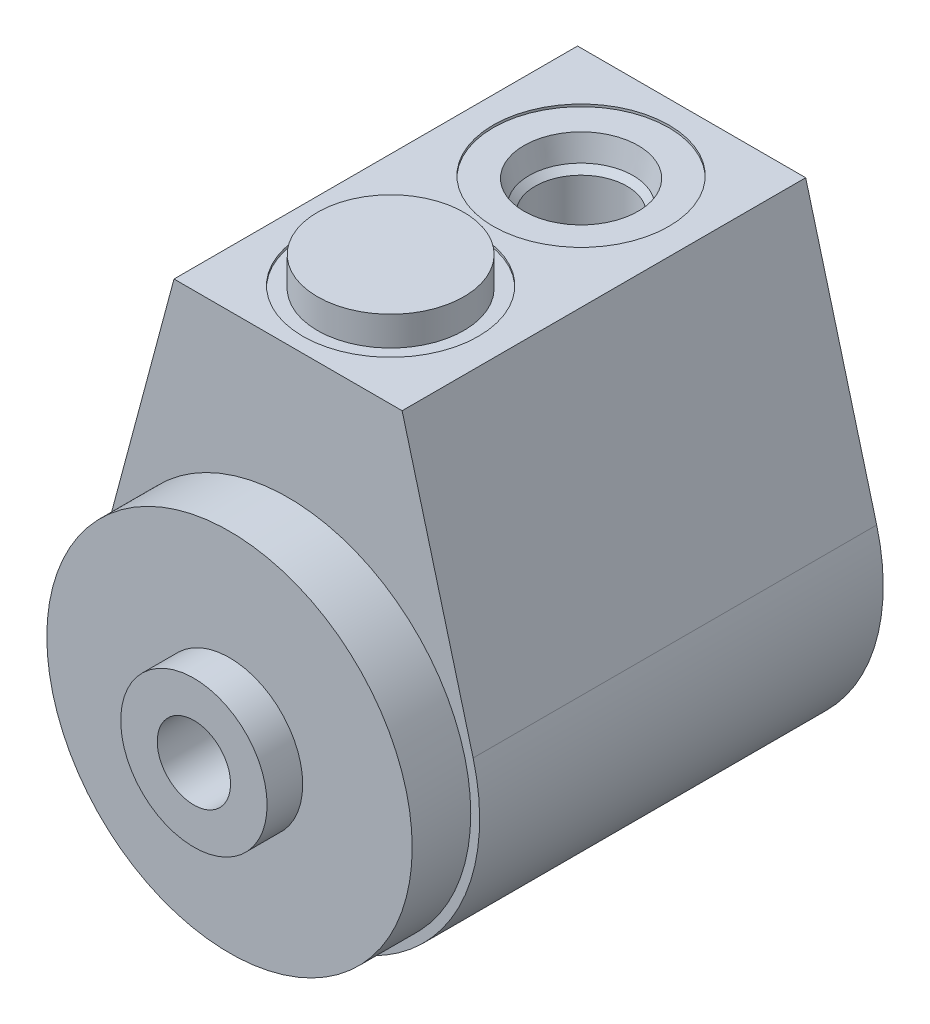
ISO-10303-21;
HEADER;
FILE_DESCRIPTION(('STEP AP214'),'2;1');
FILE_NAME('part.step','',(''),(''),'','','');
FILE_SCHEMA(('AUTOMOTIVE_DESIGN { 1 0 10303 214 1 1 1 1 }'));
ENDSEC;
DATA;
#1=APPLICATION_CONTEXT('core data for automotive mechanical design processes');
#2=APPLICATION_PROTOCOL_DEFINITION('international standard','automotive_design',2000,#1);
#3=PRODUCT_CONTEXT('',#1,'mechanical');
#4=PRODUCT('Part','Part','',(#3));
#5=PRODUCT_RELATED_PRODUCT_CATEGORY('part','',(#4));
#6=PRODUCT_DEFINITION_FORMATION('','',#4);
#7=PRODUCT_DEFINITION_CONTEXT('part definition',#1,'design');
#8=PRODUCT_DEFINITION('design','',#6,#7);
#9=PRODUCT_DEFINITION_SHAPE('','',#8);
#10=(LENGTH_UNIT() NAMED_UNIT(*) SI_UNIT(.MILLI.,.METRE.));
#11=(NAMED_UNIT(*) PLANE_ANGLE_UNIT() SI_UNIT($,.RADIAN.));
#12=(NAMED_UNIT(*) SI_UNIT($,.STERADIAN.) SOLID_ANGLE_UNIT());
#13=UNCERTAINTY_MEASURE_WITH_UNIT(LENGTH_MEASURE(1.E-05),#10,'distance_accuracy_value','');
#14=(GEOMETRIC_REPRESENTATION_CONTEXT(3) GLOBAL_UNCERTAINTY_ASSIGNED_CONTEXT((#13)) GLOBAL_UNIT_ASSIGNED_CONTEXT((#10,
#11,#12)) REPRESENTATION_CONTEXT('',''));
#15=CARTESIAN_POINT('',(0.,0.,0.));
#16=DIRECTION('',(0.,0.,1.));
#17=DIRECTION('',(1.,0.,0.));
#18=AXIS2_PLACEMENT_3D('',#15,#16,#17);
#19=CARTESIAN_POINT('',(0.,0.,3.8354));
#20=DIRECTION('',(0.,0.,1.));
#21=DIRECTION('',(1.,0.,0.));
#22=AXIS2_PLACEMENT_3D('',#19,#20,#21);
#23=PLANE('',#22);
#24=CARTESIAN_POINT('',(0.,0.,3.8354));
#25=DIRECTION('',(0.,0.,1.));
#26=DIRECTION('',(1.,0.,0.));
#27=AXIS2_PLACEMENT_3D('',#24,#25,#26);
#28=CIRCLE('',#27,7.9375);
#29=CARTESIAN_POINT('',(7.9375,0.,3.8354));
#30=VERTEX_POINT('',#29);
#31=EDGE_CURVE('E499',#30,#30,#28,.T.);
#32=ORIENTED_EDGE('',*,*,#31,.F.);
#33=EDGE_LOOP('',(#32));
#34=FACE_BOUND('',#33,.T.);
#35=CARTESIAN_POINT('',(0.,0.,3.83539999999999));
#36=DIRECTION('',(0.,0.,-1.));
#37=DIRECTION('',(-1.,0.,0.));
#38=AXIS2_PLACEMENT_3D('',#35,#36,#37);
#39=CIRCLE('',#38,5.1562);
#40=CARTESIAN_POINT('',(-5.1562,0.,3.83539999999999));
#41=VERTEX_POINT('',#40);
#42=EDGE_CURVE('E579',#41,#41,#39,.T.);
#43=ORIENTED_EDGE('',*,*,#42,.F.);
#44=EDGE_LOOP('',(#43));
#45=FACE_BOUND('',#44,.T.);
#46=ADVANCED_FACE('F36',(#34,#45),#23,.F.);
#47=CARTESIAN_POINT('',(0.,0.,4.826));
#48=DIRECTION('',(0.,0.,1.));
#49=DIRECTION('',(1.,0.,0.));
#50=AXIS2_PLACEMENT_3D('',#47,#48,#49);
#51=PLANE('',#50);
#52=CARTESIAN_POINT('',(0.,0.,4.826));
#53=DIRECTION('',(0.,0.,-1.));
#54=DIRECTION('',(-1.,0.,0.));
#55=AXIS2_PLACEMENT_3D('',#52,#53,#54);
#56=CIRCLE('',#55,10.287);
#57=CARTESIAN_POINT('',(-10.287,0.,4.826));
#58=VERTEX_POINT('',#57);
#59=EDGE_CURVE('E517',#58,#58,#56,.T.);
#60=ORIENTED_EDGE('',*,*,#59,.T.);
#61=EDGE_LOOP('',(#60));
#62=FACE_BOUND('',#61,.T.);
#63=CARTESIAN_POINT('',(0.,0.,4.826));
#64=DIRECTION('',(0.,0.,1.));
#65=DIRECTION('',(1.,0.,0.));
#66=AXIS2_PLACEMENT_3D('',#63,#64,#65);
#67=CIRCLE('',#66,7.9375);
#68=CARTESIAN_POINT('',(7.9375,0.,4.826));
#69=VERTEX_POINT('',#68);
#70=EDGE_CURVE('E11',#69,#69,#67,.F.);
#71=ORIENTED_EDGE('',*,*,#70,.F.);
#72=EDGE_LOOP('',(#71));
#73=FACE_BOUND('',#72,.T.);
#74=ADVANCED_FACE('F128',(#62,#73),#51,.F.);
#75=CARTESIAN_POINT('',(0.,0.,43.7642));
#76=DIRECTION('',(0.,0.,1.));
#77=DIRECTION('',(1.,0.,0.));
#78=AXIS2_PLACEMENT_3D('',#75,#76,#77);
#79=PLANE('',#78);
#80=CARTESIAN_POINT('',(0.,0.,43.7642));
#81=DIRECTION('',(0.,0.,1.));
#82=DIRECTION('',(1.,0.,0.));
#83=AXIS2_PLACEMENT_3D('',#80,#81,#82);
#84=CIRCLE('',#83,20.7772);
#85=CARTESIAN_POINT('',(-20.0704202210099,5.3731063633692,43.7642));
#86=VERTEX_POINT('',#85);
#87=CARTESIAN_POINT('',(20.0704202210099,5.37310636336919,43.7642));
#88=VERTEX_POINT('',#87);
#89=EDGE_CURVE('E104',#86,#88,#84,.T.);
#90=ORIENTED_EDGE('',*,*,#89,.T.);
#91=DIRECTION('',(-0.258605893160252,0.965982914974581,0.));
#92=VECTOR('',#91,1.);
#93=CARTESIAN_POINT('',(20.0704202210099,5.37310636336919,43.7642));
#94=LINE('',#93,#92);
#95=CARTESIAN_POINT('',(12.3698,34.1376,43.7642));
#96=VERTEX_POINT('',#95);
#97=EDGE_CURVE('E107',#88,#96,#94,.T.);
#98=ORIENTED_EDGE('',*,*,#97,.T.);
#99=DIRECTION('',(-1.,0.,0.));
#100=VECTOR('',#99,1.);
#101=CARTESIAN_POINT('',(12.3698,34.1376,43.7642));
#102=LINE('',#101,#100);
#103=CARTESIAN_POINT('',(-12.3698,34.1376,43.7642));
#104=VERTEX_POINT('',#103);
#105=EDGE_CURVE('E88',#96,#104,#102,.T.);
#106=ORIENTED_EDGE('',*,*,#105,.T.);
#107=DIRECTION('',(-0.258605893160253,-0.965982914974581,0.));
#108=VECTOR('',#107,1.);
#109=CARTESIAN_POINT('',(-12.3698,34.1376,43.7642));
#110=LINE('',#109,#108);
#111=EDGE_CURVE('E99',#104,#86,#110,.T.);
#112=ORIENTED_EDGE('',*,*,#111,.T.);
#113=EDGE_LOOP('',(#90,#98,#106,#112));
#114=FACE_BOUND('',#113,.T.);
#115=CARTESIAN_POINT('',(0.,0.,43.7642));
#116=DIRECTION('',(0.,0.,1.));
#117=DIRECTION('',(1.,0.,0.));
#118=AXIS2_PLACEMENT_3D('',#115,#116,#117);
#119=CIRCLE('',#118,19.812);
#120=CARTESIAN_POINT('',(19.812,0.,43.7642));
#121=VERTEX_POINT('',#120);
#122=EDGE_CURVE('E508',#121,#121,#119,.T.);
#123=ORIENTED_EDGE('',*,*,#122,.F.);
#124=EDGE_LOOP('',(#123));
#125=FACE_BOUND('',#124,.T.);
#126=ADVANCED_FACE('F115',(#114,#125),#79,.T.);
#127=CARTESIAN_POINT('',(0.,0.,0.));
#128=DIRECTION('',(0.,0.,1.));
#129=DIRECTION('',(1.,0.,0.));
#130=AXIS2_PLACEMENT_3D('',#127,#128,#129);
#131=CYLINDRICAL_SURFACE('',#130,20.7772);
#132=ORIENTED_EDGE('',*,*,#89,.F.);
#133=DIRECTION('',(0.,0.,1.));
#134=VECTOR('',#133,1.);
#135=CARTESIAN_POINT('',(-20.0704202210099,5.3731063633692,0.));
#136=LINE('',#135,#134);
#137=CARTESIAN_POINT('',(-20.0704202210099,5.3731063633692,0.));
#138=VERTEX_POINT('',#137);
#139=EDGE_CURVE('E45',#138,#86,#136,.T.);
#140=ORIENTED_EDGE('',*,*,#139,.F.);
#141=CARTESIAN_POINT('',(0.,0.,0.));
#142=DIRECTION('',(0.,0.,1.));
#143=DIRECTION('',(1.,0.,0.));
#144=AXIS2_PLACEMENT_3D('',#141,#142,#143);
#145=CIRCLE('',#144,20.7772);
#146=CARTESIAN_POINT('',(20.0704202210099,5.37310636336919,0.));
#147=VERTEX_POINT('',#146);
#148=EDGE_CURVE('E97',#138,#147,#145,.T.);
#149=ORIENTED_EDGE('',*,*,#148,.T.);
#150=DIRECTION('',(0.,0.,1.));
#151=VECTOR('',#150,1.);
#152=CARTESIAN_POINT('',(20.0704202210099,5.37310636336919,0.));
#153=LINE('',#152,#151);
#154=EDGE_CURVE('E80',#147,#88,#153,.T.);
#155=ORIENTED_EDGE('',*,*,#154,.T.);
#156=EDGE_LOOP('',(#132,#140,#149,#155));
#157=FACE_BOUND('',#156,.T.);
#158=ADVANCED_FACE('F38',(#157),#131,.T.);
#159=CARTESIAN_POINT('',(-12.3698,34.1376,0.));
#160=DIRECTION('',(-0.965982914974581,0.258605893160253,0.));
#161=DIRECTION('',(-0.258605893160253,-0.965982914974581,0.));
#162=AXIS2_PLACEMENT_3D('',#159,#160,#161);
#163=PLANE('',#162);
#164=ORIENTED_EDGE('',*,*,#111,.F.);
#165=DIRECTION('',(0.,0.,1.));
#166=VECTOR('',#165,1.);
#167=CARTESIAN_POINT('',(-12.3698,34.1376,0.));
#168=LINE('',#167,#166);
#169=CARTESIAN_POINT('',(-12.3698,34.1376,0.));
#170=VERTEX_POINT('',#169);
#171=EDGE_CURVE('E69',#170,#104,#168,.T.);
#172=ORIENTED_EDGE('',*,*,#171,.F.);
#173=DIRECTION('',(-0.258605893160253,-0.965982914974581,0.));
#174=VECTOR('',#173,1.);
#175=CARTESIAN_POINT('',(-12.3698,34.1376,0.));
#176=LINE('',#175,#174);
#177=EDGE_CURVE('E94',#170,#138,#176,.T.);
#178=ORIENTED_EDGE('',*,*,#177,.T.);
#179=ORIENTED_EDGE('',*,*,#139,.T.);
#180=EDGE_LOOP('',(#164,#172,#178,#179));
#181=FACE_BOUND('',#180,.T.);
#182=ADVANCED_FACE('F117',(#181),#163,.T.);
#183=CARTESIAN_POINT('',(12.3698,34.1376,0.));
#184=DIRECTION('',(0.,1.,0.));
#185=DIRECTION('',(0.,0.,1.));
#186=AXIS2_PLACEMENT_3D('',#183,#184,#185);
#187=PLANE('',#186);
#188=CARTESIAN_POINT('',(0.,34.1376000000385,11.9888));
#189=DIRECTION('',(0.,1.,0.));
#190=DIRECTION('',(0.,0.,1.));
#191=AXIS2_PLACEMENT_3D('',#188,#189,#190);
#192=CIRCLE('',#191,9.52499999998575);
#193=CARTESIAN_POINT('',(0.,34.1376000000385,21.5137999999857));
#194=VERTEX_POINT('',#193);
#195=EDGE_CURVE('E487',#194,#194,#192,.T.);
#196=ORIENTED_EDGE('',*,*,#195,.F.);
#197=EDGE_LOOP('',(#196));
#198=FACE_BOUND('',#197,.T.);
#199=CARTESIAN_POINT('',(0.,34.1376,32.639));
#200=DIRECTION('',(0.,1.,0.));
#201=DIRECTION('',(0.,0.,1.));
#202=AXIS2_PLACEMENT_3D('',#199,#200,#201);
#203=CIRCLE('',#202,9.52500000000001);
#204=CARTESIAN_POINT('',(0.,34.1376,42.164));
#205=VERTEX_POINT('',#204);
#206=EDGE_CURVE('E520',#205,#205,#203,.T.);
#207=ORIENTED_EDGE('',*,*,#206,.F.);
#208=EDGE_LOOP('',(#207));
#209=FACE_BOUND('',#208,.T.);
#210=ORIENTED_EDGE('',*,*,#105,.F.);
#211=DIRECTION('',(0.,0.,1.));
#212=VECTOR('',#211,1.);
#213=CARTESIAN_POINT('',(12.3698,34.1376,0.));
#214=LINE('',#213,#212);
#215=CARTESIAN_POINT('',(12.3698,34.1376,0.));
#216=VERTEX_POINT('',#215);
#217=EDGE_CURVE('E83',#216,#96,#214,.T.);
#218=ORIENTED_EDGE('',*,*,#217,.F.);
#219=DIRECTION('',(-1.,0.,0.));
#220=VECTOR('',#219,1.);
#221=CARTESIAN_POINT('',(12.3698,34.1376,0.));
#222=LINE('',#221,#220);
#223=EDGE_CURVE('E86',#216,#170,#222,.T.);
#224=ORIENTED_EDGE('',*,*,#223,.T.);
#225=ORIENTED_EDGE('',*,*,#171,.T.);
#226=EDGE_LOOP('',(#210,#218,#224,#225));
#227=FACE_BOUND('',#226,.T.);
#228=ADVANCED_FACE('F85',(#198,#209,#227),#187,.T.);
#229=CARTESIAN_POINT('',(20.0704202210099,5.37310636336919,0.));
#230=DIRECTION('',(0.965982914974581,0.258605893160252,0.));
#231=DIRECTION('',(-0.258605893160252,0.965982914974581,0.));
#232=AXIS2_PLACEMENT_3D('',#229,#230,#231);
#233=PLANE('',#232);
#234=ORIENTED_EDGE('',*,*,#97,.F.);
#235=ORIENTED_EDGE('',*,*,#154,.F.);
#236=DIRECTION('',(-0.258605893160252,0.965982914974581,0.));
#237=VECTOR('',#236,1.);
#238=CARTESIAN_POINT('',(20.0704202210099,5.37310636336919,0.));
#239=LINE('',#238,#237);
#240=EDGE_CURVE('E93',#147,#216,#239,.T.);
#241=ORIENTED_EDGE('',*,*,#240,.T.);
#242=ORIENTED_EDGE('',*,*,#217,.T.);
#243=EDGE_LOOP('',(#234,#235,#241,#242));
#244=FACE_BOUND('',#243,.T.);
#245=ADVANCED_FACE('F96',(#244),#233,.T.);
#246=CARTESIAN_POINT('',(0.,0.,0.));
#247=DIRECTION('',(0.,0.,1.));
#248=DIRECTION('',(1.,0.,0.));
#249=AXIS2_PLACEMENT_3D('',#246,#247,#248);
#250=PLANE('',#249);
#251=CARTESIAN_POINT('',(-15.875,-1.10854596715223E-13,0.));
#252=DIRECTION('',(0.,0.,-1.));
#253=DIRECTION('',(-1.,0.,0.));
#254=AXIS2_PLACEMENT_3D('',#251,#252,#253);
#255=CIRCLE('',#254,2.59080000000001);
#256=CARTESIAN_POINT('',(-18.4658,-1.10854596715223E-13,0.));
#257=VERTEX_POINT('',#256);
#258=EDGE_CURVE('E567',#257,#257,#255,.T.);
#259=ORIENTED_EDGE('',*,*,#258,.F.);
#260=EDGE_LOOP('',(#259));
#261=FACE_BOUND('',#260,.T.);
#262=CARTESIAN_POINT('',(15.875,0.,0.));
#263=DIRECTION('',(0.,0.,-1.));
#264=DIRECTION('',(-1.,0.,0.));
#265=AXIS2_PLACEMENT_3D('',#262,#263,#264);
#266=CIRCLE('',#265,2.59080000000001);
#267=CARTESIAN_POINT('',(13.2842,0.,0.));
#268=VERTEX_POINT('',#267);
#269=EDGE_CURVE('E561',#268,#268,#266,.T.);
#270=ORIENTED_EDGE('',*,*,#269,.F.);
#271=EDGE_LOOP('',(#270));
#272=FACE_BOUND('',#271,.T.);
#273=CARTESIAN_POINT('',(0.,0.,0.));
#274=DIRECTION('',(0.,0.,-1.));
#275=DIRECTION('',(-1.,0.,0.));
#276=AXIS2_PLACEMENT_3D('',#273,#274,#275);
#277=CIRCLE('',#276,10.287);
#278=CARTESIAN_POINT('',(-10.287,0.,0.));
#279=VERTEX_POINT('',#278);
#280=EDGE_CURVE('E514',#279,#279,#277,.T.);
#281=ORIENTED_EDGE('',*,*,#280,.F.);
#282=EDGE_LOOP('',(#281));
#283=FACE_BOUND('',#282,.T.);
#284=ORIENTED_EDGE('',*,*,#148,.F.);
#285=ORIENTED_EDGE('',*,*,#177,.F.);
#286=ORIENTED_EDGE('',*,*,#223,.F.);
#287=ORIENTED_EDGE('',*,*,#240,.F.);
#288=EDGE_LOOP('',(#284,#285,#286,#287));
#289=FACE_BOUND('',#288,.T.);
#290=ADVANCED_FACE('F92',(#261,#272,#283,#289),#250,.F.);
#291=CARTESIAN_POINT('',(0.,33.8836,32.639));
#292=DIRECTION('',(0.,-1.,0.));
#293=DIRECTION('',(0.,0.,-1.));
#294=AXIS2_PLACEMENT_3D('',#291,#292,#293);
#295=PLANE('',#294);
#296=CARTESIAN_POINT('',(0.,33.8836,32.639));
#297=DIRECTION('',(0.,1.,0.));
#298=DIRECTION('',(0.,0.,1.));
#299=AXIS2_PLACEMENT_3D('',#296,#297,#298);
#300=CIRCLE('',#299,7.9375);
#301=CARTESIAN_POINT('',(0.,33.8836,40.5765));
#302=VERTEX_POINT('',#301);
#303=EDGE_CURVE('E496',#302,#302,#300,.T.);
#304=ORIENTED_EDGE('',*,*,#303,.F.);
#305=EDGE_LOOP('',(#304));
#306=FACE_BOUND('',#305,.T.);
#307=CARTESIAN_POINT('',(0.,33.8836,32.639));
#308=DIRECTION('',(0.,1.,0.));
#309=DIRECTION('',(0.,0.,1.));
#310=AXIS2_PLACEMENT_3D('',#307,#308,#309);
#311=CIRCLE('',#310,9.52500000000001);
#312=CARTESIAN_POINT('',(0.,33.8836,42.164));
#313=VERTEX_POINT('',#312);
#314=EDGE_CURVE('E108',#313,#313,#311,.T.);
#315=ORIENTED_EDGE('',*,*,#314,.T.);
#316=EDGE_LOOP('',(#315));
#317=FACE_BOUND('',#316,.T.);
#318=ADVANCED_FACE('F169',(#306,#317),#295,.F.);
#319=CARTESIAN_POINT('',(0.,34.1376,32.639));
#320=DIRECTION('',(0.,1.,0.));
#321=DIRECTION('',(0.,0.,1.));
#322=AXIS2_PLACEMENT_3D('',#319,#320,#321);
#323=CYLINDRICAL_SURFACE('',#322,9.52500000000001);
#324=ORIENTED_EDGE('',*,*,#314,.F.);
#325=EDGE_LOOP('',(#324));
#326=FACE_BOUND('',#325,.T.);
#327=ORIENTED_EDGE('',*,*,#206,.T.);
#328=EDGE_LOOP('',(#327));
#329=FACE_BOUND('',#328,.T.);
#330=ADVANCED_FACE('F164',(#326,#329),#323,.F.);
#331=CARTESIAN_POINT('',(0.,0.,0.));
#332=DIRECTION('',(0.,0.,-1.));
#333=DIRECTION('',(-1.,0.,0.));
#334=AXIS2_PLACEMENT_3D('',#331,#332,#333);
#335=CYLINDRICAL_SURFACE('',#334,10.287);
#336=ORIENTED_EDGE('',*,*,#59,.F.);
#337=EDGE_LOOP('',(#336));
#338=FACE_BOUND('',#337,.T.);
#339=ORIENTED_EDGE('',*,*,#280,.T.);
#340=EDGE_LOOP('',(#339));
#341=FACE_BOUND('',#340,.T.);
#342=ADVANCED_FACE('F161',(#338,#341),#335,.F.);
#343=CARTESIAN_POINT('',(0.,0.,0.));
#344=DIRECTION('',(0.,0.,1.));
#345=DIRECTION('',(1.,0.,0.));
#346=AXIS2_PLACEMENT_3D('',#343,#344,#345);
#347=CYLINDRICAL_SURFACE('',#346,7.9375);
#348=CARTESIAN_POINT('',(0.,0.,53.975));
#349=DIRECTION('',(0.,0.,1.));
#350=DIRECTION('',(1.,0.,0.));
#351=AXIS2_PLACEMENT_3D('',#348,#349,#350);
#352=CIRCLE('',#351,7.9375);
#353=CARTESIAN_POINT('',(7.9375,0.,53.975));
#354=VERTEX_POINT('',#353);
#355=EDGE_CURVE('E511',#354,#354,#352,.T.);
#356=ORIENTED_EDGE('',*,*,#355,.F.);
#357=EDGE_LOOP('',(#356));
#358=FACE_BOUND('',#357,.T.);
#359=CARTESIAN_POINT('',(0.,0.,50.1142));
#360=DIRECTION('',(0.,0.,1.));
#361=DIRECTION('',(1.,0.,0.));
#362=AXIS2_PLACEMENT_3D('',#359,#360,#361);
#363=CIRCLE('',#362,7.9375);
#364=CARTESIAN_POINT('',(7.9375,0.,50.1142));
#365=VERTEX_POINT('',#364);
#366=EDGE_CURVE('E502',#365,#365,#363,.T.);
#367=ORIENTED_EDGE('',*,*,#366,.T.);
#368=EDGE_LOOP('',(#367));
#369=FACE_BOUND('',#368,.T.);
#370=ADVANCED_FACE('F157',(#358,#369),#347,.T.);
#371=CARTESIAN_POINT('',(7.9375,0.,53.975));
#372=DIRECTION('',(0.,0.,-1.));
#373=DIRECTION('',(-1.,0.,0.));
#374=AXIS2_PLACEMENT_3D('',#371,#372,#373);
#375=PLANE('',#374);
#376=CARTESIAN_POINT('',(0.,0.,53.975));
#377=DIRECTION('',(0.,0.,-1.));
#378=DIRECTION('',(-1.,0.,0.));
#379=AXIS2_PLACEMENT_3D('',#376,#377,#378);
#380=CIRCLE('',#379,3.9751);
#381=CARTESIAN_POINT('',(-3.9751,0.,53.975));
#382=VERTEX_POINT('',#381);
#383=EDGE_CURVE('E570',#382,#382,#380,.T.);
#384=ORIENTED_EDGE('',*,*,#383,.T.);
#385=EDGE_LOOP('',(#384));
#386=FACE_BOUND('',#385,.T.);
#387=ORIENTED_EDGE('',*,*,#355,.T.);
#388=EDGE_LOOP('',(#387));
#389=FACE_BOUND('',#388,.T.);
#390=ADVANCED_FACE('F153',(#386,#389),#375,.F.);
#391=CARTESIAN_POINT('',(0.,0.,0.));
#392=DIRECTION('',(0.,0.,1.));
#393=DIRECTION('',(1.,0.,0.));
#394=AXIS2_PLACEMENT_3D('',#391,#392,#393);
#395=CYLINDRICAL_SURFACE('',#394,19.812);
#396=CARTESIAN_POINT('',(0.,0.,50.1142));
#397=DIRECTION('',(0.,0.,1.));
#398=DIRECTION('',(1.,0.,0.));
#399=AXIS2_PLACEMENT_3D('',#396,#397,#398);
#400=CIRCLE('',#399,19.812);
#401=CARTESIAN_POINT('',(19.812,0.,50.1142));
#402=VERTEX_POINT('',#401);
#403=EDGE_CURVE('E505',#402,#402,#400,.T.);
#404=ORIENTED_EDGE('',*,*,#403,.F.);
#405=EDGE_LOOP('',(#404));
#406=FACE_BOUND('',#405,.T.);
#407=ORIENTED_EDGE('',*,*,#122,.T.);
#408=EDGE_LOOP('',(#407));
#409=FACE_BOUND('',#408,.T.);
#410=ADVANCED_FACE('F149',(#406,#409),#395,.T.);
#411=CARTESIAN_POINT('',(19.812,0.,50.1142));
#412=DIRECTION('',(0.,0.,-1.));
#413=DIRECTION('',(-1.,0.,0.));
#414=AXIS2_PLACEMENT_3D('',#411,#412,#413);
#415=PLANE('',#414);
#416=ORIENTED_EDGE('',*,*,#366,.F.);
#417=EDGE_LOOP('',(#416));
#418=FACE_BOUND('',#417,.T.);
#419=ORIENTED_EDGE('',*,*,#403,.T.);
#420=EDGE_LOOP('',(#419));
#421=FACE_BOUND('',#420,.T.);
#422=ADVANCED_FACE('F145',(#418,#421),#415,.F.);
#423=CARTESIAN_POINT('',(0.,0.,0.));
#424=DIRECTION('',(0.,0.,1.));
#425=DIRECTION('',(1.,0.,0.));
#426=AXIS2_PLACEMENT_3D('',#423,#424,#425);
#427=CYLINDRICAL_SURFACE('',#426,7.9375);
#428=ORIENTED_EDGE('',*,*,#70,.T.);
#429=EDGE_LOOP('',(#428));
#430=FACE_BOUND('',#429,.T.);
#431=ORIENTED_EDGE('',*,*,#31,.T.);
#432=EDGE_LOOP('',(#431));
#433=FACE_BOUND('',#432,.T.);
#434=ADVANCED_FACE('F142',(#430,#433),#427,.T.);
#435=CARTESIAN_POINT('',(0.,0.,32.639));
#436=DIRECTION('',(0.,1.,0.));
#437=DIRECTION('',(0.,0.,1.));
#438=AXIS2_PLACEMENT_3D('',#435,#436,#437);
#439=CYLINDRICAL_SURFACE('',#438,7.9375);
#440=ORIENTED_EDGE('',*,*,#303,.T.);
#441=EDGE_LOOP('',(#440));
#442=FACE_BOUND('',#441,.T.);
#443=CARTESIAN_POINT('',(0.,37.0586,32.639));
#444=DIRECTION('',(0.,1.,0.));
#445=DIRECTION('',(0.,0.,1.));
#446=AXIS2_PLACEMENT_3D('',#443,#444,#445);
#447=CIRCLE('',#446,7.9375);
#448=CARTESIAN_POINT('',(0.,37.0586,40.5765));
#449=VERTEX_POINT('',#448);
#450=EDGE_CURVE('E493',#449,#449,#447,.T.);
#451=ORIENTED_EDGE('',*,*,#450,.F.);
#452=EDGE_LOOP('',(#451));
#453=FACE_BOUND('',#452,.T.);
#454=ADVANCED_FACE('F140',(#442,#453),#439,.T.);
#455=CARTESIAN_POINT('',(0.,37.0586,32.639));
#456=DIRECTION('',(0.,1.,0.));
#457=DIRECTION('',(0.,0.,1.));
#458=AXIS2_PLACEMENT_3D('',#455,#456,#457);
#459=PLANE('',#458);
#460=ORIENTED_EDGE('',*,*,#450,.T.);
#461=EDGE_LOOP('',(#460));
#462=FACE_BOUND('',#461,.T.);
#463=ADVANCED_FACE('F241',(#462),#459,.T.);
#464=CARTESIAN_POINT('',(0.,13.3096,11.9888));
#465=DIRECTION('',(0.,1.,0.));
#466=DIRECTION('',(0.,0.,1.));
#467=AXIS2_PLACEMENT_3D('',#464,#465,#466);
#468=CYLINDRICAL_SURFACE('',#467,4.9784);
#469=CARTESIAN_POINT('',(0.,13.3096,11.9888));
#470=DIRECTION('',(0.,1.,0.));
#471=DIRECTION('',(0.,0.,1.));
#472=AXIS2_PLACEMENT_3D('',#469,#470,#471);
#473=CIRCLE('',#472,4.9784);
#474=CARTESIAN_POINT('',(0.,13.3096,16.9672));
#475=VERTEX_POINT('',#474);
#476=EDGE_CURVE('E490',#475,#475,#473,.T.);
#477=ORIENTED_EDGE('',*,*,#476,.F.);
#478=EDGE_LOOP('',(#477));
#479=FACE_BOUND('',#478,.T.);
#480=CARTESIAN_POINT('',(0.,30.6669931349751,11.9888));
#481=DIRECTION('',(0.,1.,0.));
#482=DIRECTION('',(0.,0.,1.));
#483=AXIS2_PLACEMENT_3D('',#480,#481,#482);
#484=CIRCLE('',#483,4.97839999999999);
#485=CARTESIAN_POINT('',(0.,30.6669931349751,16.9672));
#486=VERTEX_POINT('',#485);
#487=EDGE_CURVE('E475',#486,#486,#484,.T.);
#488=ORIENTED_EDGE('',*,*,#487,.T.);
#489=EDGE_LOOP('',(#488));
#490=FACE_BOUND('',#489,.T.);
#491=ADVANCED_FACE('F248',(#479,#490),#468,.F.);
#492=CARTESIAN_POINT('',(4.9784,13.3096,11.9888));
#493=DIRECTION('',(0.,-1.,0.));
#494=DIRECTION('',(0.,0.,-1.));
#495=AXIS2_PLACEMENT_3D('',#492,#493,#494);
#496=PLANE('',#495);
#497=ORIENTED_EDGE('',*,*,#476,.T.);
#498=EDGE_LOOP('',(#497));
#499=FACE_BOUND('',#498,.T.);
#500=ADVANCED_FACE('F256',(#499),#496,.F.);
#501=CARTESIAN_POINT('',(0.,13.3096,11.9888));
#502=DIRECTION('',(0.,1.,0.));
#503=DIRECTION('',(0.,0.,1.));
#504=AXIS2_PLACEMENT_3D('',#501,#502,#503);
#505=CYLINDRICAL_SURFACE('',#504,9.52499999998575);
#506=CARTESIAN_POINT('',(0.,33.8836000000385,11.9888));
#507=DIRECTION('',(0.,1.,0.));
#508=DIRECTION('',(0.,0.,1.));
#509=AXIS2_PLACEMENT_3D('',#506,#507,#508);
#510=CIRCLE('',#509,9.52499999998575);
#511=CARTESIAN_POINT('',(0.,33.8836000000385,21.5137999999857));
#512=VERTEX_POINT('',#511);
#513=EDGE_CURVE('E484',#512,#512,#510,.T.);
#514=ORIENTED_EDGE('',*,*,#513,.F.);
#515=EDGE_LOOP('',(#514));
#516=FACE_BOUND('',#515,.T.);
#517=ORIENTED_EDGE('',*,*,#195,.T.);
#518=EDGE_LOOP('',(#517));
#519=FACE_BOUND('',#518,.T.);
#520=ADVANCED_FACE('F264',(#516,#519),#505,.F.);
#521=CARTESIAN_POINT('',(9.52499999998575,33.8836000000385,11.9888));
#522=DIRECTION('',(0.,-1.,0.));
#523=DIRECTION('',(0.,0.,-1.));
#524=AXIS2_PLACEMENT_3D('',#521,#522,#523);
#525=PLANE('',#524);
#526=CARTESIAN_POINT('',(0.,33.8836000000385,11.9888));
#527=DIRECTION('',(0.,1.,0.));
#528=DIRECTION('',(0.,0.,1.));
#529=AXIS2_PLACEMENT_3D('',#526,#527,#528);
#530=CIRCLE('',#529,6.18490000002008);
#531=CARTESIAN_POINT('',(0.,33.8836000000385,18.1737000000201));
#532=VERTEX_POINT('',#531);
#533=EDGE_CURVE('E481',#532,#532,#530,.T.);
#534=ORIENTED_EDGE('',*,*,#533,.F.);
#535=EDGE_LOOP('',(#534));
#536=FACE_BOUND('',#535,.T.);
#537=ORIENTED_EDGE('',*,*,#513,.T.);
#538=EDGE_LOOP('',(#537));
#539=FACE_BOUND('',#538,.T.);
#540=ADVANCED_FACE('F272',(#536,#539),#525,.F.);
#541=CARTESIAN_POINT('',(0.,33.8836000000385,11.9888));
#542=DIRECTION('',(0.,1.,0.));
#543=DIRECTION('',(0.,0.,1.));
#544=AXIS2_PLACEMENT_3D('',#541,#542,#543);
#545=CONICAL_SURFACE('',#544,6.18490000002008,0.20943951023946);
#546=CARTESIAN_POINT('',(0.,31.3309000000146,11.9888));
#547=DIRECTION('',(0.,1.,0.));
#548=DIRECTION('',(0.,0.,1.));
#549=AXIS2_PLACEMENT_3D('',#546,#547,#548);
#550=CIRCLE('',#549,5.64230686503958);
#551=CARTESIAN_POINT('',(0.,31.3309000000146,17.6311068650396));
#552=VERTEX_POINT('',#551);
#553=EDGE_CURVE('E478',#552,#552,#550,.T.);
#554=ORIENTED_EDGE('',*,*,#553,.F.);
#555=EDGE_LOOP('',(#554));
#556=FACE_BOUND('',#555,.T.);
#557=ORIENTED_EDGE('',*,*,#533,.T.);
#558=EDGE_LOOP('',(#557));
#559=FACE_BOUND('',#558,.T.);
#560=ADVANCED_FACE('F280',(#556,#559),#545,.F.);
#561=CARTESIAN_POINT('',(0.,31.3309000000146,11.9888));
#562=DIRECTION('',(0.,1.,0.));
#563=DIRECTION('',(0.,0.,1.));
#564=AXIS2_PLACEMENT_3D('',#561,#562,#563);
#565=CONICAL_SURFACE('',#564,5.64230686503958,0.785398163397457);
#566=ORIENTED_EDGE('',*,*,#487,.F.);
#567=EDGE_LOOP('',(#566));
#568=FACE_BOUND('',#567,.T.);
#569=ORIENTED_EDGE('',*,*,#553,.T.);
#570=EDGE_LOOP('',(#569));
#571=FACE_BOUND('',#570,.T.);
#572=ADVANCED_FACE('F288',(#568,#571),#565,.F.);
#573=CARTESIAN_POINT('',(15.875,0.,10.922));
#574=DIRECTION('',(0.,0.,1.));
#575=DIRECTION('',(1.,0.,0.));
#576=AXIS2_PLACEMENT_3D('',#573,#574,#575);
#577=PLANE('',#576);
#578=CARTESIAN_POINT('',(15.875,0.,10.922));
#579=DIRECTION('',(0.,0.,-1.));
#580=DIRECTION('',(-1.,0.,0.));
#581=AXIS2_PLACEMENT_3D('',#578,#579,#580);
#582=CIRCLE('',#581,2.59080000000001);
#583=CARTESIAN_POINT('',(13.2842,0.,10.922));
#584=VERTEX_POINT('',#583);
#585=EDGE_CURVE('E469',#584,#584,#582,.T.);
#586=ORIENTED_EDGE('',*,*,#585,.T.);
#587=EDGE_LOOP('',(#586));
#588=FACE_BOUND('',#587,.T.);
#589=ADVANCED_FACE('F296',(#588),#577,.F.);
#590=CARTESIAN_POINT('',(15.875,0.,0.));
#591=DIRECTION('',(0.,0.,-1.));
#592=DIRECTION('',(-1.,0.,0.));
#593=AXIS2_PLACEMENT_3D('',#590,#591,#592);
#594=CYLINDRICAL_SURFACE('',#593,2.59080000000001);
#595=ORIENTED_EDGE('',*,*,#585,.F.);
#596=EDGE_LOOP('',(#595));
#597=FACE_BOUND('',#596,.T.);
#598=ORIENTED_EDGE('',*,*,#269,.T.);
#599=EDGE_LOOP('',(#598));
#600=FACE_BOUND('',#599,.T.);
#601=ADVANCED_FACE('F305',(#597,#600),#594,.F.);
#602=CARTESIAN_POINT('',(-15.875,-1.10854596715223E-13,10.922));
#603=DIRECTION('',(0.,0.,1.));
#604=DIRECTION('',(1.,0.,0.));
#605=AXIS2_PLACEMENT_3D('',#602,#603,#604);
#606=PLANE('',#605);
#607=CARTESIAN_POINT('',(-15.875,-1.10854596715223E-13,10.922));
#608=DIRECTION('',(0.,0.,-1.));
#609=DIRECTION('',(-1.,0.,0.));
#610=AXIS2_PLACEMENT_3D('',#607,#608,#609);
#611=CIRCLE('',#610,2.59080000000001);
#612=CARTESIAN_POINT('',(-18.4658,-1.10854596715223E-13,10.922));
#613=VERTEX_POINT('',#612);
#614=EDGE_CURVE('E564',#613,#613,#611,.T.);
#615=ORIENTED_EDGE('',*,*,#614,.T.);
#616=EDGE_LOOP('',(#615));
#617=FACE_BOUND('',#616,.T.);
#618=ADVANCED_FACE('F314',(#617),#606,.F.);
#619=CARTESIAN_POINT('',(-15.875,-1.10854596715223E-13,0.));
#620=DIRECTION('',(0.,0.,-1.));
#621=DIRECTION('',(-1.,0.,0.));
#622=AXIS2_PLACEMENT_3D('',#619,#620,#621);
#623=CYLINDRICAL_SURFACE('',#622,2.59080000000001);
#624=ORIENTED_EDGE('',*,*,#614,.F.);
#625=EDGE_LOOP('',(#624));
#626=FACE_BOUND('',#625,.T.);
#627=ORIENTED_EDGE('',*,*,#258,.T.);
#628=EDGE_LOOP('',(#627));
#629=FACE_BOUND('',#628,.T.);
#630=ADVANCED_FACE('F323',(#626,#629),#623,.F.);
#631=CARTESIAN_POINT('',(0.,0.,3.8354));
#632=DIRECTION('',(0.,0.,-1.));
#633=DIRECTION('',(-1.,0.,0.));
#634=AXIS2_PLACEMENT_3D('',#631,#632,#633);
#635=CYLINDRICAL_SURFACE('',#634,3.9751);
#636=ORIENTED_EDGE('',*,*,#383,.F.);
#637=EDGE_LOOP('',(#636));
#638=FACE_BOUND('',#637,.T.);
#639=CARTESIAN_POINT('',(0.,0.,39.5970764771334));
#640=DIRECTION('',(0.,0.,-1.));
#641=DIRECTION('',(-1.,0.,0.));
#642=AXIS2_PLACEMENT_3D('',#639,#640,#641);
#643=CIRCLE('',#642,3.97510000000001);
#644=CARTESIAN_POINT('',(-3.97510000000001,0.,39.5970764771334));
#645=VERTEX_POINT('',#644);
#646=EDGE_CURVE('E573',#645,#645,#643,.T.);
#647=ORIENTED_EDGE('',*,*,#646,.T.);
#648=EDGE_LOOP('',(#647));
#649=FACE_BOUND('',#648,.T.);
#650=ADVANCED_FACE('F331',(#638,#649),#635,.F.);
#651=CARTESIAN_POINT('',(0.,0.,38.8874));
#652=DIRECTION('',(0.,0.,-1.));
#653=DIRECTION('',(-1.,0.,0.));
#654=AXIS2_PLACEMENT_3D('',#651,#652,#653);
#655=CONICAL_SURFACE('',#654,5.15619999999999,1.02974425867665);
#656=ORIENTED_EDGE('',*,*,#646,.F.);
#657=EDGE_LOOP('',(#656));
#658=FACE_BOUND('',#657,.T.);
#659=CARTESIAN_POINT('',(0.,0.,38.8874));
#660=DIRECTION('',(0.,0.,-1.));
#661=DIRECTION('',(-1.,0.,0.));
#662=AXIS2_PLACEMENT_3D('',#659,#660,#661);
#663=CIRCLE('',#662,5.15619999999999);
#664=CARTESIAN_POINT('',(-5.15619999999999,0.,38.8874));
#665=VERTEX_POINT('',#664);
#666=EDGE_CURVE('E576',#665,#665,#663,.T.);
#667=ORIENTED_EDGE('',*,*,#666,.T.);
#668=EDGE_LOOP('',(#667));
#669=FACE_BOUND('',#668,.T.);
#670=ADVANCED_FACE('F338',(#658,#669),#655,.F.);
#671=CARTESIAN_POINT('',(0.,0.,3.8354));
#672=DIRECTION('',(0.,0.,-1.));
#673=DIRECTION('',(-1.,0.,0.));
#674=AXIS2_PLACEMENT_3D('',#671,#672,#673);
#675=CYLINDRICAL_SURFACE('',#674,5.1562);
#676=ORIENTED_EDGE('',*,*,#666,.F.);
#677=EDGE_LOOP('',(#676));
#678=FACE_BOUND('',#677,.T.);
#679=ORIENTED_EDGE('',*,*,#42,.T.);
#680=EDGE_LOOP('',(#679));
#681=FACE_BOUND('',#680,.T.);
#682=ADVANCED_FACE('F346',(#678,#681),#675,.F.);
#683=CLOSED_SHELL('',(#46,#74,#126,#158,#182,#228,#245,#290,#318,#330,#342,#370,#390,#410,#422,
#434,#454,#463,#491,#500,#520,#540,#560,#572,#589,#601,#618,#630,#650,#670,#682));
#684=CARTESIAN_POINT('',(0.,31.3309,32.639));
#685=DIRECTION('',(0.,1.,0.));
#686=DIRECTION('',(0.,0.,1.));
#687=AXIS2_PLACEMENT_3D('',#684,#685,#686);
#688=CONICAL_SURFACE('',#687,5.64230686502494,0.209439510252188);
#689=CARTESIAN_POINT('',(0.,33.8836,32.639));
#690=DIRECTION('',(0.,-1.,0.));
#691=DIRECTION('',(0.,0.,-1.));
#692=AXIS2_PLACEMENT_3D('',#689,#690,#691);
#693=CIRCLE('',#692,6.18490000003434);
#694=CARTESIAN_POINT('',(0.,33.8836,26.4540999999657));
#695=VERTEX_POINT('',#694);
#696=EDGE_CURVE('E467',#695,#695,#693,.T.);
#697=ORIENTED_EDGE('',*,*,#696,.F.);
#698=EDGE_LOOP('',(#697));
#699=FACE_BOUND('',#698,.T.);
#700=CARTESIAN_POINT('',(0.,31.3309,32.639));
#701=DIRECTION('',(0.,-1.,0.));
#702=DIRECTION('',(0.,0.,-1.));
#703=AXIS2_PLACEMENT_3D('',#700,#701,#702);
#704=CIRCLE('',#703,5.64230686502494);
#705=CARTESIAN_POINT('',(0.,31.3309,26.9966931349751));
#706=VERTEX_POINT('',#705);
#707=EDGE_CURVE('E460',#706,#706,#704,.T.);
#708=ORIENTED_EDGE('',*,*,#707,.T.);
#709=EDGE_LOOP('',(#708));
#710=FACE_BOUND('',#709,.T.);
#711=ADVANCED_FACE('F358',(#699,#710),#688,.F.);
#712=CARTESIAN_POINT('',(6.18490000003434,33.8836,32.639));
#713=DIRECTION('',(0.,1.,0.));
#714=DIRECTION('',(0.,0.,1.));
#715=AXIS2_PLACEMENT_3D('',#712,#713,#714);
#716=PLANE('',#715);
#717=ORIENTED_EDGE('',*,*,#696,.T.);
#718=EDGE_LOOP('',(#717));
#719=FACE_BOUND('',#718,.T.);
#720=ADVANCED_FACE('F361',(#719),#716,.F.);
#721=CARTESIAN_POINT('',(0.,20.4215999999758,32.639));
#722=DIRECTION('',(0.,-1.,0.));
#723=DIRECTION('',(0.,0.,-1.));
#724=AXIS2_PLACEMENT_3D('',#721,#722,#723);
#725=PLANE('',#724);
#726=CARTESIAN_POINT('',(0.,20.4215999999758,32.639));
#727=DIRECTION('',(0.,-1.,0.));
#728=DIRECTION('',(0.,0.,-1.));
#729=AXIS2_PLACEMENT_3D('',#726,#727,#728);
#730=CIRCLE('',#729,4.97840000000001);
#731=CARTESIAN_POINT('',(0.,20.4215999999758,27.6606));
#732=VERTEX_POINT('',#731);
#733=EDGE_CURVE('E464',#732,#732,#730,.T.);
#734=ORIENTED_EDGE('',*,*,#733,.F.);
#735=EDGE_LOOP('',(#734));
#736=FACE_BOUND('',#735,.T.);
#737=ADVANCED_FACE('F370',(#736),#725,.F.);
#738=CARTESIAN_POINT('',(0.,33.8836,32.639));
#739=DIRECTION('',(0.,-1.,0.));
#740=DIRECTION('',(0.,0.,-1.));
#741=AXIS2_PLACEMENT_3D('',#738,#739,#740);
#742=CYLINDRICAL_SURFACE('',#741,4.9784);
#743=CARTESIAN_POINT('',(0.,30.6669931349751,32.639));
#744=DIRECTION('',(0.,-1.,0.));
#745=DIRECTION('',(0.,0.,-1.));
#746=AXIS2_PLACEMENT_3D('',#743,#744,#745);
#747=CIRCLE('',#746,4.9784);
#748=CARTESIAN_POINT('',(0.,30.6669931349751,27.6606));
#749=VERTEX_POINT('',#748);
#750=EDGE_CURVE('E463',#749,#749,#747,.T.);
#751=ORIENTED_EDGE('',*,*,#750,.F.);
#752=EDGE_LOOP('',(#751));
#753=FACE_BOUND('',#752,.T.);
#754=ORIENTED_EDGE('',*,*,#733,.T.);
#755=EDGE_LOOP('',(#754));
#756=FACE_BOUND('',#755,.T.);
#757=ADVANCED_FACE('F378',(#753,#756),#742,.F.);
#758=CARTESIAN_POINT('',(0.,30.6669931349751,32.639));
#759=DIRECTION('',(0.,1.,0.));
#760=DIRECTION('',(0.,0.,1.));
#761=AXIS2_PLACEMENT_3D('',#758,#759,#760);
#762=CONICAL_SURFACE('',#761,4.9784,0.785398163397457);
#763=ORIENTED_EDGE('',*,*,#707,.F.);
#764=EDGE_LOOP('',(#763));
#765=FACE_BOUND('',#764,.T.);
#766=ORIENTED_EDGE('',*,*,#750,.T.);
#767=EDGE_LOOP('',(#766));
#768=FACE_BOUND('',#767,.T.);
#769=ADVANCED_FACE('F386',(#765,#768),#762,.F.);
#770=CLOSED_SHELL('',(#711,#720,#737,#757,#769));
#771=ORIENTED_CLOSED_SHELL('',*,#770,.T.);
#772=BREP_WITH_VOIDS('B2',#683,(#771));
#773=ADVANCED_BREP_SHAPE_REPRESENTATION('',(#18,#772),#14);
#774=SHAPE_DEFINITION_REPRESENTATION(#9,#773);
ENDSEC;
END-ISO-10303-21;
